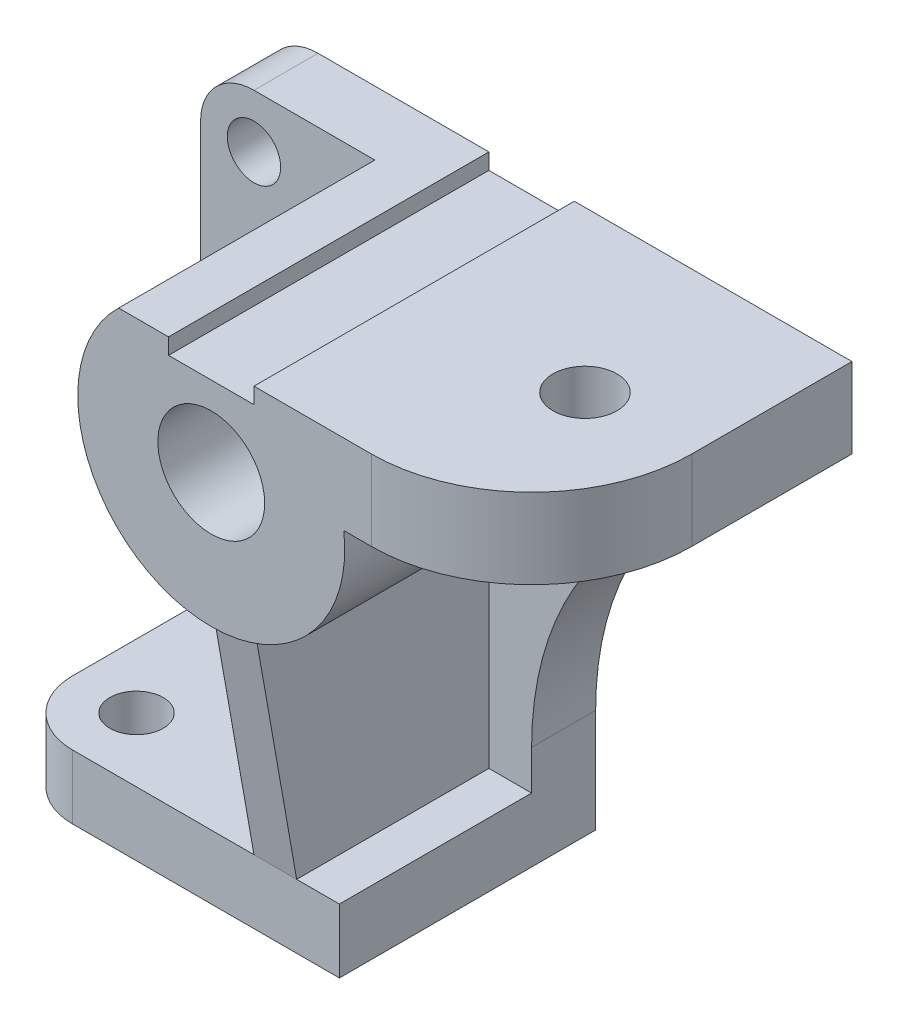
ISO-10303-21;
HEADER;
FILE_DESCRIPTION(('STEP AP214'),'2;1');
FILE_NAME('part.step','',(''),(''),'','','');
FILE_SCHEMA(('AUTOMOTIVE_DESIGN { 1 0 10303 214 1 1 1 1 }'));
ENDSEC;
DATA;
#1=APPLICATION_CONTEXT('core data for automotive mechanical design processes');
#2=APPLICATION_PROTOCOL_DEFINITION('international standard','automotive_design',2000,#1);
#3=PRODUCT_CONTEXT('',#1,'mechanical');
#4=PRODUCT('Part','Part','',(#3));
#5=PRODUCT_RELATED_PRODUCT_CATEGORY('part','',(#4));
#6=PRODUCT_DEFINITION_FORMATION('','',#4);
#7=PRODUCT_DEFINITION_CONTEXT('part definition',#1,'design');
#8=PRODUCT_DEFINITION('design','',#6,#7);
#9=PRODUCT_DEFINITION_SHAPE('','',#8);
#10=(LENGTH_UNIT() NAMED_UNIT(*) SI_UNIT(.MILLI.,.METRE.));
#11=(NAMED_UNIT(*) PLANE_ANGLE_UNIT() SI_UNIT($,.RADIAN.));
#12=(NAMED_UNIT(*) SI_UNIT($,.STERADIAN.) SOLID_ANGLE_UNIT());
#13=UNCERTAINTY_MEASURE_WITH_UNIT(LENGTH_MEASURE(1.E-05),#10,'distance_accuracy_value','');
#14=(GEOMETRIC_REPRESENTATION_CONTEXT(3) GLOBAL_UNCERTAINTY_ASSIGNED_CONTEXT((#13)) GLOBAL_UNIT_ASSIGNED_CONTEXT((#10,
#11,#12)) REPRESENTATION_CONTEXT('',''));
#15=CARTESIAN_POINT('',(0.,0.,0.));
#16=DIRECTION('',(0.,0.,1.));
#17=DIRECTION('',(1.,0.,0.));
#18=AXIS2_PLACEMENT_3D('',#15,#16,#17);
#19=CARTESIAN_POINT('',(122.,19.4182867015248,12.));
#20=DIRECTION('',(0.,0.,-1.));
#21=DIRECTION('',(-1.,0.,0.));
#22=AXIS2_PLACEMENT_3D('',#19,#20,#21);
#23=PLANE('',#22);
#24=CARTESIAN_POINT('',(10.,90.,12.));
#25=DIRECTION('',(0.,0.,1.));
#26=DIRECTION('',(1.,0.,0.));
#27=AXIS2_PLACEMENT_3D('',#24,#25,#26);
#28=CIRCLE('',#27,5.);
#29=CARTESIAN_POINT('',(15.,90.,12.));
#30=VERTEX_POINT('',#29);
#31=EDGE_CURVE('E321',#30,#30,#28,.T.);
#32=ORIENTED_EDGE('',*,*,#31,.F.);
#33=EDGE_LOOP('',(#32));
#34=FACE_BOUND('',#33,.T.);
#35=DIRECTION('',(0.,-1.,0.));
#36=VECTOR('',#35,1.);
#37=CARTESIAN_POINT('',(46.,19.4182867015248,12.));
#38=LINE('',#37,#36);
#39=CARTESIAN_POINT('',(46.,57.3220746414939,12.));
#40=VERTEX_POINT('',#39);
#41=CARTESIAN_POINT('',(46.,12.,12.));
#42=VERTEX_POINT('',#41);
#43=EDGE_CURVE('E207',#40,#42,#38,.T.);
#44=ORIENTED_EDGE('',*,*,#43,.F.);
#45=CARTESIAN_POINT('',(50.,82.,12.));
#46=DIRECTION('',(0.,0.,1.));
#47=DIRECTION('',(1.,0.,0.));
#48=AXIS2_PLACEMENT_3D('',#45,#46,#47);
#49=CIRCLE('',#48,25.);
#50=CARTESIAN_POINT('',(32.6506484271025,100.,12.));
#51=VERTEX_POINT('',#50);
#52=EDGE_CURVE('E191',#51,#40,#49,.T.);
#53=ORIENTED_EDGE('',*,*,#52,.F.);
#54=DIRECTION('',(-1.,0.,0.));
#55=VECTOR('',#54,1.);
#56=CARTESIAN_POINT('',(10.,100.,12.));
#57=LINE('',#56,#55);
#58=CARTESIAN_POINT('',(10.,100.,12.));
#59=VERTEX_POINT('',#58);
#60=EDGE_CURVE('E327',#51,#59,#57,.T.);
#61=ORIENTED_EDGE('',*,*,#60,.T.);
#62=CARTESIAN_POINT('',(10.,90.,12.));
#63=DIRECTION('',(0.,0.,1.));
#64=DIRECTION('',(1.,0.,0.));
#65=AXIS2_PLACEMENT_3D('',#62,#63,#64);
#66=CIRCLE('',#65,10.);
#67=CARTESIAN_POINT('',(0.,90.,12.));
#68=VERTEX_POINT('',#67);
#69=EDGE_CURVE('E329',#59,#68,#66,.T.);
#70=ORIENTED_EDGE('',*,*,#69,.T.);
#71=DIRECTION('',(0.,-1.,0.));
#72=VECTOR('',#71,1.);
#73=CARTESIAN_POINT('',(0.,90.,12.));
#74=LINE('',#73,#72);
#75=CARTESIAN_POINT('',(0.,12.,12.));
#76=VERTEX_POINT('',#75);
#77=EDGE_CURVE('E332',#68,#76,#74,.T.);
#78=ORIENTED_EDGE('',*,*,#77,.T.);
#79=DIRECTION('',(1.,0.,0.));
#80=VECTOR('',#79,1.);
#81=CARTESIAN_POINT('',(0.,12.,12.));
#82=LINE('',#81,#80);
#83=EDGE_CURVE('E209',#76,#42,#82,.T.);
#84=ORIENTED_EDGE('',*,*,#83,.T.);
#85=EDGE_LOOP('',(#44,#53,#61,#70,#78,#84));
#86=FACE_BOUND('',#85,.T.);
#87=ADVANCED_FACE('F36',(#34,#86),#23,.F.);
#88=CARTESIAN_POINT('',(12.,12.,36.));
#89=DIRECTION('',(0.,-1.,0.));
#90=DIRECTION('',(0.,0.,-1.));
#91=AXIS2_PLACEMENT_3D('',#88,#89,#90);
#92=PLANE('',#91);
#93=CARTESIAN_POINT('',(12.,12.,36.));
#94=DIRECTION('',(0.,-1.,0.));
#95=DIRECTION('',(0.,0.,-1.));
#96=AXIS2_PLACEMENT_3D('',#93,#94,#95);
#97=CIRCLE('',#96,5.);
#98=CARTESIAN_POINT('',(12.,12.,31.));
#99=VERTEX_POINT('',#98);
#100=EDGE_CURVE('E288',#99,#99,#97,.T.);
#101=ORIENTED_EDGE('',*,*,#100,.T.);
#102=EDGE_LOOP('',(#101));
#103=FACE_BOUND('',#102,.T.);
#104=DIRECTION('',(0.,0.,1.));
#105=VECTOR('',#104,1.);
#106=CARTESIAN_POINT('',(46.,12.,36.));
#107=LINE('',#106,#105);
#108=CARTESIAN_POINT('',(46.,12.,48.));
#109=VERTEX_POINT('',#108);
#110=EDGE_CURVE('E212',#42,#109,#107,.T.);
#111=ORIENTED_EDGE('',*,*,#110,.F.);
#112=ORIENTED_EDGE('',*,*,#83,.F.);
#113=DIRECTION('',(0.,0.,-1.));
#114=VECTOR('',#113,1.);
#115=CARTESIAN_POINT('',(0.,12.,12.));
#116=LINE('',#115,#114);
#117=CARTESIAN_POINT('',(0.,12.,35.9999999999999));
#118=VERTEX_POINT('',#117);
#119=EDGE_CURVE('E304',#118,#76,#116,.T.);
#120=ORIENTED_EDGE('',*,*,#119,.F.);
#121=CARTESIAN_POINT('',(12.,12.,36.));
#122=DIRECTION('',(0.,-1.,0.));
#123=DIRECTION('',(0.,0.,-1.));
#124=AXIS2_PLACEMENT_3D('',#121,#122,#123);
#125=CIRCLE('',#124,12.);
#126=CARTESIAN_POINT('',(12.0000000000001,12.,48.));
#127=VERTEX_POINT('',#126);
#128=EDGE_CURVE('E301',#127,#118,#125,.T.);
#129=ORIENTED_EDGE('',*,*,#128,.F.);
#130=DIRECTION('',(-1.,0.,0.));
#131=VECTOR('',#130,1.);
#132=CARTESIAN_POINT('',(62.,12.,48.));
#133=LINE('',#132,#131);
#134=EDGE_CURVE('E51',#109,#127,#133,.T.);
#135=ORIENTED_EDGE('',*,*,#134,.F.);
#136=EDGE_LOOP('',(#111,#112,#120,#129,#135));
#137=FACE_BOUND('',#136,.T.);
#138=ADVANCED_FACE('F473',(#103,#137),#92,.F.);
#139=CARTESIAN_POINT('',(10.,100.,12.));
#140=DIRECTION('',(0.,-1.,0.));
#141=DIRECTION('',(0.,0.,-1.));
#142=AXIS2_PLACEMENT_3D('',#139,#140,#141);
#143=PLANE('',#142);
#144=DIRECTION('',(-1.,0.,0.));
#145=VECTOR('',#144,1.);
#146=CARTESIAN_POINT('',(32.6506484271025,100.,60.));
#147=LINE('',#146,#145);
#148=CARTESIAN_POINT('',(42.,100.,60.));
#149=VERTEX_POINT('',#148);
#150=CARTESIAN_POINT('',(32.6506484271025,100.,60.));
#151=VERTEX_POINT('',#150);
#152=EDGE_CURVE('E277',#149,#151,#147,.T.);
#153=ORIENTED_EDGE('',*,*,#152,.F.);
#154=DIRECTION('',(0.,0.,1.));
#155=VECTOR('',#154,1.);
#156=CARTESIAN_POINT('',(42.,100.,0.));
#157=LINE('',#156,#155);
#158=CARTESIAN_POINT('',(42.,100.,0.));
#159=VERTEX_POINT('',#158);
#160=EDGE_CURVE('E255',#159,#149,#157,.T.);
#161=ORIENTED_EDGE('',*,*,#160,.F.);
#162=DIRECTION('',(-1.,0.,0.));
#163=VECTOR('',#162,1.);
#164=CARTESIAN_POINT('',(10.,100.,0.));
#165=LINE('',#164,#163);
#166=CARTESIAN_POINT('',(10.,100.,0.));
#167=VERTEX_POINT('',#166);
#168=EDGE_CURVE('E343',#159,#167,#165,.T.);
#169=ORIENTED_EDGE('',*,*,#168,.T.);
#170=DIRECTION('',(0.,0.,-1.));
#171=VECTOR('',#170,1.);
#172=CARTESIAN_POINT('',(10.,100.,12.));
#173=LINE('',#172,#171);
#174=EDGE_CURVE('E380',#59,#167,#173,.T.);
#175=ORIENTED_EDGE('',*,*,#174,.F.);
#176=ORIENTED_EDGE('',*,*,#60,.F.);
#177=DIRECTION('',(0.,0.,-1.));
#178=VECTOR('',#177,1.);
#179=CARTESIAN_POINT('',(32.6506484271025,100.,60.));
#180=LINE('',#179,#178);
#181=EDGE_CURVE('E199',#151,#51,#180,.T.);
#182=ORIENTED_EDGE('',*,*,#181,.F.);
#183=EDGE_LOOP('',(#153,#161,#169,#175,#176,#182));
#184=FACE_BOUND('',#183,.T.);
#185=ADVANCED_FACE('F426',(#184),#143,.F.);
#186=CARTESIAN_POINT('',(54.,57.3220746414939,12.));
#187=VERTEX_POINT('',#186);
#188=CARTESIAN_POINT('',(74.8193472919817,85.,12.));
#189=VERTEX_POINT('',#188);
#190=EDGE_CURVE('E203',#187,#189,#49,.T.);
#191=ORIENTED_EDGE('',*,*,#190,.F.);
#192=DIRECTION('',(0.,-1.,0.));
#193=VECTOR('',#192,1.);
#194=CARTESIAN_POINT('',(54.,19.4182867015248,12.));
#195=LINE('',#194,#193);
#196=CARTESIAN_POINT('',(54.,12.,12.));
#197=VERTEX_POINT('',#196);
#198=EDGE_CURVE('E227',#187,#197,#195,.T.);
#199=ORIENTED_EDGE('',*,*,#198,.T.);
#200=CARTESIAN_POINT('',(62.,12.,12.));
#201=VERTEX_POINT('',#200);
#202=EDGE_CURVE('E296',#197,#201,#82,.T.);
#203=ORIENTED_EDGE('',*,*,#202,.T.);
#204=DIRECTION('',(0.,1.,0.));
#205=VECTOR('',#204,1.);
#206=CARTESIAN_POINT('',(62.,0.,12.));
#207=LINE('',#206,#205);
#208=CARTESIAN_POINT('',(62.,19.4182867015248,12.));
#209=VERTEX_POINT('',#208);
#210=EDGE_CURVE('E334',#201,#209,#207,.T.);
#211=ORIENTED_EDGE('',*,*,#210,.T.);
#212=CARTESIAN_POINT('',(122.,19.4182867015248,12.));
#213=DIRECTION('',(0.,0.,-1.));
#214=DIRECTION('',(-1.,0.,0.));
#215=AXIS2_PLACEMENT_3D('',#212,#213,#214);
#216=CIRCLE('',#215,60.);
#217=CARTESIAN_POINT('',(95.,73.,12.));
#218=VERTEX_POINT('',#217);
#219=EDGE_CURVE('E336',#209,#218,#216,.T.);
#220=ORIENTED_EDGE('',*,*,#219,.T.);
#221=DIRECTION('',(0.,1.,0.));
#222=VECTOR('',#221,1.);
#223=CARTESIAN_POINT('',(95.,85.,12.));
#224=LINE('',#223,#222);
#225=CARTESIAN_POINT('',(95.,85.,12.));
#226=VERTEX_POINT('',#225);
#227=EDGE_CURVE('E338',#218,#226,#224,.T.);
#228=ORIENTED_EDGE('',*,*,#227,.T.);
#229=DIRECTION('',(1.,0.,0.));
#230=VECTOR('',#229,1.);
#231=CARTESIAN_POINT('',(110.,85.,12.));
#232=LINE('',#231,#230);
#233=EDGE_CURVE('E202',#189,#226,#232,.T.);
#234=ORIENTED_EDGE('',*,*,#233,.F.);
#235=EDGE_LOOP('',(#191,#199,#203,#211,#220,#228,#234));
#236=FACE_BOUND('',#235,.T.);
#237=ADVANCED_FACE('F433',(#236),#23,.F.);
#238=CARTESIAN_POINT('',(122.,19.4182867015248,0.));
#239=DIRECTION('',(0.,0.,-1.));
#240=DIRECTION('',(-1.,0.,0.));
#241=AXIS2_PLACEMENT_3D('',#238,#239,#240);
#242=PLANE('',#241);
#243=CARTESIAN_POINT('',(50.,82.,0.));
#244=DIRECTION('',(0.,0.,1.));
#245=DIRECTION('',(1.,0.,0.));
#246=AXIS2_PLACEMENT_3D('',#243,#244,#245);
#247=CIRCLE('',#246,10.);
#248=CARTESIAN_POINT('',(60.,82.,0.));
#249=VERTEX_POINT('',#248);
#250=EDGE_CURVE('E266',#249,#249,#247,.T.);
#251=ORIENTED_EDGE('',*,*,#250,.T.);
#252=EDGE_LOOP('',(#251));
#253=FACE_BOUND('',#252,.T.);
#254=DIRECTION('',(1.,0.,0.));
#255=VECTOR('',#254,1.);
#256=CARTESIAN_POINT('',(42.,97.,0.));
#257=LINE('',#256,#255);
#258=CARTESIAN_POINT('',(42.,97.,0.));
#259=VERTEX_POINT('',#258);
#260=CARTESIAN_POINT('',(58.,97.,0.));
#261=VERTEX_POINT('',#260);
#262=EDGE_CURVE('E244',#259,#261,#257,.T.);
#263=ORIENTED_EDGE('',*,*,#262,.T.);
#264=DIRECTION('',(0.,1.,0.));
#265=VECTOR('',#264,1.);
#266=CARTESIAN_POINT('',(58.,100.,0.));
#267=LINE('',#266,#265);
#268=CARTESIAN_POINT('',(58.,100.,0.));
#269=VERTEX_POINT('',#268);
#270=EDGE_CURVE('E247',#261,#269,#267,.T.);
#271=ORIENTED_EDGE('',*,*,#270,.T.);
#272=CARTESIAN_POINT('',(110.,100.,0.));
#273=VERTEX_POINT('',#272);
#274=EDGE_CURVE('E344',#273,#269,#165,.T.);
#275=ORIENTED_EDGE('',*,*,#274,.F.);
#276=DIRECTION('',(0.,1.,0.));
#277=VECTOR('',#276,1.);
#278=CARTESIAN_POINT('',(110.,100.,0.));
#279=LINE('',#278,#277);
#280=CARTESIAN_POINT('',(110.,85.,0.));
#281=VERTEX_POINT('',#280);
#282=EDGE_CURVE('E324',#281,#273,#279,.T.);
#283=ORIENTED_EDGE('',*,*,#282,.F.);
#284=DIRECTION('',(1.,0.,0.));
#285=VECTOR('',#284,1.);
#286=CARTESIAN_POINT('',(110.,85.,0.));
#287=LINE('',#286,#285);
#288=CARTESIAN_POINT('',(95.,85.,0.));
#289=VERTEX_POINT('',#288);
#290=EDGE_CURVE('E330',#289,#281,#287,.T.);
#291=ORIENTED_EDGE('',*,*,#290,.F.);
#292=DIRECTION('',(0.,1.,0.));
#293=VECTOR('',#292,1.);
#294=CARTESIAN_POINT('',(95.,85.,0.));
#295=LINE('',#294,#293);
#296=CARTESIAN_POINT('',(95.,73.,0.));
#297=VERTEX_POINT('',#296);
#298=EDGE_CURVE('E357',#297,#289,#295,.T.);
#299=ORIENTED_EDGE('',*,*,#298,.F.);
#300=CARTESIAN_POINT('',(122.,19.4182867015248,0.));
#301=DIRECTION('',(0.,0.,-1.));
#302=DIRECTION('',(-1.,0.,0.));
#303=AXIS2_PLACEMENT_3D('',#300,#301,#302);
#304=CIRCLE('',#303,60.);
#305=CARTESIAN_POINT('',(62.,19.4182867015248,0.));
#306=VERTEX_POINT('',#305);
#307=EDGE_CURVE('E355',#306,#297,#304,.T.);
#308=ORIENTED_EDGE('',*,*,#307,.F.);
#309=DIRECTION('',(0.,1.,0.));
#310=VECTOR('',#309,1.);
#311=CARTESIAN_POINT('',(62.,0.,0.));
#312=LINE('',#311,#310);
#313=CARTESIAN_POINT('',(62.,0.,0.));
#314=VERTEX_POINT('',#313);
#315=EDGE_CURVE('E353',#314,#306,#312,.T.);
#316=ORIENTED_EDGE('',*,*,#315,.F.);
#317=DIRECTION('',(1.,0.,0.));
#318=VECTOR('',#317,1.);
#319=CARTESIAN_POINT('',(0.,0.,0.));
#320=LINE('',#319,#318);
#321=CARTESIAN_POINT('',(0.,0.,0.));
#322=VERTEX_POINT('',#321);
#323=EDGE_CURVE('E351',#322,#314,#320,.T.);
#324=ORIENTED_EDGE('',*,*,#323,.F.);
#325=DIRECTION('',(0.,-1.,0.));
#326=VECTOR('',#325,1.);
#327=CARTESIAN_POINT('',(0.,90.,0.));
#328=LINE('',#327,#326);
#329=CARTESIAN_POINT('',(0.,90.,0.));
#330=VERTEX_POINT('',#329);
#331=EDGE_CURVE('E349',#330,#322,#328,.T.);
#332=ORIENTED_EDGE('',*,*,#331,.F.);
#333=CARTESIAN_POINT('',(10.,90.,0.));
#334=DIRECTION('',(0.,0.,1.));
#335=DIRECTION('',(1.,0.,0.));
#336=AXIS2_PLACEMENT_3D('',#333,#334,#335);
#337=CIRCLE('',#336,10.);
#338=EDGE_CURVE('E347',#167,#330,#337,.T.);
#339=ORIENTED_EDGE('',*,*,#338,.F.);
#340=ORIENTED_EDGE('',*,*,#168,.F.);
#341=DIRECTION('',(0.,-1.,0.));
#342=VECTOR('',#341,1.);
#343=CARTESIAN_POINT('',(42.,100.,0.));
#344=LINE('',#343,#342);
#345=EDGE_CURVE('E241',#159,#259,#344,.T.);
#346=ORIENTED_EDGE('',*,*,#345,.T.);
#347=EDGE_LOOP('',(#263,#271,#275,#283,#291,#299,#308,#316,#324,#332,#339,#340,#346));
#348=FACE_BOUND('',#347,.T.);
#349=CARTESIAN_POINT('',(10.,90.,0.));
#350=DIRECTION('',(0.,0.,1.));
#351=DIRECTION('',(1.,0.,0.));
#352=AXIS2_PLACEMENT_3D('',#349,#350,#351);
#353=CIRCLE('',#352,5.);
#354=CARTESIAN_POINT('',(15.,90.,0.));
#355=VERTEX_POINT('',#354);
#356=EDGE_CURVE('E316',#355,#355,#353,.T.);
#357=ORIENTED_EDGE('',*,*,#356,.T.);
#358=EDGE_LOOP('',(#357));
#359=FACE_BOUND('',#358,.T.);
#360=ADVANCED_FACE('F413',(#253,#348,#359),#242,.T.);
#361=CARTESIAN_POINT('',(110.,100.,12.));
#362=DIRECTION('',(-1.,0.,0.));
#363=DIRECTION('',(0.,-1.,0.));
#364=AXIS2_PLACEMENT_3D('',#361,#362,#363);
#365=PLANE('',#364);
#366=DIRECTION('',(0.,0.,-1.));
#367=VECTOR('',#366,1.);
#368=CARTESIAN_POINT('',(110.,100.,12.));
#369=LINE('',#368,#367);
#370=CARTESIAN_POINT('',(110.,100.,30.));
#371=VERTEX_POINT('',#370);
#372=EDGE_CURVE('E383',#371,#273,#369,.T.);
#373=ORIENTED_EDGE('',*,*,#372,.F.);
#374=DIRECTION('',(0.,1.,0.));
#375=VECTOR('',#374,1.);
#376=CARTESIAN_POINT('',(110.,85.,30.));
#377=LINE('',#376,#375);
#378=CARTESIAN_POINT('',(110.,85.,30.));
#379=VERTEX_POINT('',#378);
#380=EDGE_CURVE('E44',#371,#379,#377,.F.);
#381=ORIENTED_EDGE('',*,*,#380,.T.);
#382=DIRECTION('',(0.,0.,-1.));
#383=VECTOR('',#382,1.);
#384=CARTESIAN_POINT('',(110.,85.,12.));
#385=LINE('',#384,#383);
#386=EDGE_CURVE('E340',#379,#281,#385,.T.);
#387=ORIENTED_EDGE('',*,*,#386,.T.);
#388=ORIENTED_EDGE('',*,*,#282,.T.);
#389=EDGE_LOOP('',(#373,#381,#387,#388));
#390=FACE_BOUND('',#389,.T.);
#391=ADVANCED_FACE('F393',(#390),#365,.F.);
#392=CARTESIAN_POINT('',(90.,100.,30.));
#393=DIRECTION('',(0.,1.,0.));
#394=DIRECTION('',(0.,0.,1.));
#395=AXIS2_PLACEMENT_3D('',#392,#393,#394);
#396=CIRCLE('',#395,6.);
#397=CARTESIAN_POINT('',(90.,100.,36.));
#398=VERTEX_POINT('',#397);
#399=EDGE_CURVE('E234',#398,#398,#396,.T.);
#400=ORIENTED_EDGE('',*,*,#399,.F.);
#401=EDGE_LOOP('',(#400));
#402=FACE_BOUND('',#401,.T.);
#403=ORIENTED_EDGE('',*,*,#274,.T.);
#404=DIRECTION('',(0.,0.,1.));
#405=VECTOR('',#404,1.);
#406=CARTESIAN_POINT('',(58.,100.,0.));
#407=LINE('',#406,#405);
#408=CARTESIAN_POINT('',(58.,100.,60.));
#409=VERTEX_POINT('',#408);
#410=EDGE_CURVE('E258',#269,#409,#407,.T.);
#411=ORIENTED_EDGE('',*,*,#410,.T.);
#412=CARTESIAN_POINT('',(80.,100.,60.));
#413=VERTEX_POINT('',#412);
#414=EDGE_CURVE('E278',#413,#409,#147,.T.);
#415=ORIENTED_EDGE('',*,*,#414,.F.);
#416=CARTESIAN_POINT('',(80.,100.,30.));
#417=DIRECTION('',(0.,-1.,0.));
#418=DIRECTION('',(0.,0.,-1.));
#419=AXIS2_PLACEMENT_3D('',#416,#417,#418);
#420=CIRCLE('',#419,30.);
#421=EDGE_CURVE('E388',#413,#371,#420,.F.);
#422=ORIENTED_EDGE('',*,*,#421,.T.);
#423=ORIENTED_EDGE('',*,*,#372,.T.);
#424=EDGE_LOOP('',(#403,#411,#415,#422,#423));
#425=FACE_BOUND('',#424,.T.);
#426=ADVANCED_FACE('F407',(#402,#425),#143,.F.);
#427=CARTESIAN_POINT('',(10.,90.,12.));
#428=DIRECTION('',(0.,0.,-1.));
#429=DIRECTION('',(-1.,0.,0.));
#430=AXIS2_PLACEMENT_3D('',#427,#428,#429);
#431=CYLINDRICAL_SURFACE('',#430,10.);
#432=ORIENTED_EDGE('',*,*,#338,.T.);
#433=DIRECTION('',(0.,0.,-1.));
#434=VECTOR('',#433,1.);
#435=CARTESIAN_POINT('',(0.,90.,12.));
#436=LINE('',#435,#434);
#437=EDGE_CURVE('E377',#68,#330,#436,.T.);
#438=ORIENTED_EDGE('',*,*,#437,.F.);
#439=ORIENTED_EDGE('',*,*,#69,.F.);
#440=ORIENTED_EDGE('',*,*,#174,.T.);
#441=EDGE_LOOP('',(#432,#438,#439,#440));
#442=FACE_BOUND('',#441,.T.);
#443=ADVANCED_FACE('F462',(#442),#431,.T.);
#444=CARTESIAN_POINT('',(0.,90.,12.));
#445=DIRECTION('',(1.,0.,0.));
#446=DIRECTION('',(0.,0.,-1.));
#447=AXIS2_PLACEMENT_3D('',#444,#445,#446);
#448=PLANE('',#447);
#449=ORIENTED_EDGE('',*,*,#331,.T.);
#450=DIRECTION('',(0.,0.,-1.));
#451=VECTOR('',#450,1.);
#452=CARTESIAN_POINT('',(0.,0.,12.));
#453=LINE('',#452,#451);
#454=CARTESIAN_POINT('',(0.,0.,35.9999999999999));
#455=VERTEX_POINT('',#454);
#456=EDGE_CURVE('E374',#455,#322,#453,.T.);
#457=ORIENTED_EDGE('',*,*,#456,.F.);
#458=DIRECTION('',(0.,-1.,0.));
#459=VECTOR('',#458,1.);
#460=CARTESIAN_POINT('',(0.,12.,35.9999999999999));
#461=LINE('',#460,#459);
#462=EDGE_CURVE('E313',#118,#455,#461,.T.);
#463=ORIENTED_EDGE('',*,*,#462,.F.);
#464=ORIENTED_EDGE('',*,*,#119,.T.);
#465=ORIENTED_EDGE('',*,*,#77,.F.);
#466=ORIENTED_EDGE('',*,*,#437,.T.);
#467=EDGE_LOOP('',(#449,#457,#463,#464,#465,#466));
#468=FACE_BOUND('',#467,.T.);
#469=ADVANCED_FACE('F457',(#468),#448,.F.);
#470=CARTESIAN_POINT('',(0.,0.,12.));
#471=DIRECTION('',(0.,1.,0.));
#472=DIRECTION('',(0.,0.,1.));
#473=AXIS2_PLACEMENT_3D('',#470,#471,#472);
#474=PLANE('',#473);
#475=ORIENTED_EDGE('',*,*,#323,.T.);
#476=DIRECTION('',(0.,0.,-1.));
#477=VECTOR('',#476,1.);
#478=CARTESIAN_POINT('',(62.,0.,12.));
#479=LINE('',#478,#477);
#480=CARTESIAN_POINT('',(62.,0.,48.));
#481=VERTEX_POINT('',#480);
#482=EDGE_CURVE('E371',#481,#314,#479,.T.);
#483=ORIENTED_EDGE('',*,*,#482,.F.);
#484=DIRECTION('',(-1.,0.,0.));
#485=VECTOR('',#484,1.);
#486=CARTESIAN_POINT('',(62.,0.,48.));
#487=LINE('',#486,#485);
#488=CARTESIAN_POINT('',(12.0000000000001,0.,48.));
#489=VERTEX_POINT('',#488);
#490=EDGE_CURVE('E291',#481,#489,#487,.T.);
#491=ORIENTED_EDGE('',*,*,#490,.T.);
#492=CARTESIAN_POINT('',(12.,0.,36.));
#493=DIRECTION('',(0.,-1.,0.));
#494=DIRECTION('',(0.,0.,-1.));
#495=AXIS2_PLACEMENT_3D('',#492,#493,#494);
#496=CIRCLE('',#495,12.);
#497=EDGE_CURVE('E310',#489,#455,#496,.T.);
#498=ORIENTED_EDGE('',*,*,#497,.T.);
#499=ORIENTED_EDGE('',*,*,#456,.T.);
#500=EDGE_LOOP('',(#475,#483,#491,#498,#499));
#501=FACE_BOUND('',#500,.T.);
#502=CARTESIAN_POINT('',(12.,0.,36.));
#503=DIRECTION('',(0.,-1.,0.));
#504=DIRECTION('',(0.,0.,-1.));
#505=AXIS2_PLACEMENT_3D('',#502,#503,#504);
#506=CIRCLE('',#505,5.);
#507=CARTESIAN_POINT('',(12.,0.,31.));
#508=VERTEX_POINT('',#507);
#509=EDGE_CURVE('E287',#508,#508,#506,.T.);
#510=ORIENTED_EDGE('',*,*,#509,.F.);
#511=EDGE_LOOP('',(#510));
#512=FACE_BOUND('',#511,.T.);
#513=ADVANCED_FACE('F452',(#501,#512),#474,.F.);
#514=CARTESIAN_POINT('',(62.,0.,12.));
#515=DIRECTION('',(-1.,0.,0.));
#516=DIRECTION('',(0.,0.,1.));
#517=AXIS2_PLACEMENT_3D('',#514,#515,#516);
#518=PLANE('',#517);
#519=ORIENTED_EDGE('',*,*,#315,.T.);
#520=DIRECTION('',(0.,0.,-1.));
#521=VECTOR('',#520,1.);
#522=CARTESIAN_POINT('',(62.,19.4182867015248,12.));
#523=LINE('',#522,#521);
#524=EDGE_CURVE('E368',#209,#306,#523,.T.);
#525=ORIENTED_EDGE('',*,*,#524,.F.);
#526=ORIENTED_EDGE('',*,*,#210,.F.);
#527=DIRECTION('',(0.,0.,1.));
#528=VECTOR('',#527,1.);
#529=CARTESIAN_POINT('',(62.,12.,12.));
#530=LINE('',#529,#528);
#531=CARTESIAN_POINT('',(62.,12.,48.));
#532=VERTEX_POINT('',#531);
#533=EDGE_CURVE('E295',#201,#532,#530,.T.);
#534=ORIENTED_EDGE('',*,*,#533,.T.);
#535=DIRECTION('',(0.,-1.,0.));
#536=VECTOR('',#535,1.);
#537=CARTESIAN_POINT('',(62.,12.,48.));
#538=LINE('',#537,#536);
#539=EDGE_CURVE('E307',#532,#481,#538,.T.);
#540=ORIENTED_EDGE('',*,*,#539,.T.);
#541=ORIENTED_EDGE('',*,*,#482,.T.);
#542=EDGE_LOOP('',(#519,#525,#526,#534,#540,#541));
#543=FACE_BOUND('',#542,.T.);
#544=ADVANCED_FACE('F449',(#543),#518,.F.);
#545=CARTESIAN_POINT('',(122.,19.4182867015248,12.));
#546=DIRECTION('',(0.,0.,-1.));
#547=DIRECTION('',(-1.,0.,0.));
#548=AXIS2_PLACEMENT_3D('',#545,#546,#547);
#549=CYLINDRICAL_SURFACE('',#548,60.);
#550=ORIENTED_EDGE('',*,*,#307,.T.);
#551=DIRECTION('',(0.,0.,-1.));
#552=VECTOR('',#551,1.);
#553=CARTESIAN_POINT('',(95.,73.,12.));
#554=LINE('',#553,#552);
#555=EDGE_CURVE('E365',#218,#297,#554,.T.);
#556=ORIENTED_EDGE('',*,*,#555,.F.);
#557=ORIENTED_EDGE('',*,*,#219,.F.);
#558=ORIENTED_EDGE('',*,*,#524,.T.);
#559=EDGE_LOOP('',(#550,#556,#557,#558));
#560=FACE_BOUND('',#559,.T.);
#561=ADVANCED_FACE('F445',(#560),#549,.F.);
#562=CARTESIAN_POINT('',(95.,85.,12.));
#563=DIRECTION('',(-1.,0.,0.));
#564=DIRECTION('',(0.,0.,1.));
#565=AXIS2_PLACEMENT_3D('',#562,#563,#564);
#566=PLANE('',#565);
#567=ORIENTED_EDGE('',*,*,#298,.T.);
#568=DIRECTION('',(0.,0.,-1.));
#569=VECTOR('',#568,1.);
#570=CARTESIAN_POINT('',(95.,85.,12.));
#571=LINE('',#570,#569);
#572=EDGE_CURVE('E362',#226,#289,#571,.T.);
#573=ORIENTED_EDGE('',*,*,#572,.F.);
#574=ORIENTED_EDGE('',*,*,#227,.F.);
#575=ORIENTED_EDGE('',*,*,#555,.T.);
#576=EDGE_LOOP('',(#567,#573,#574,#575));
#577=FACE_BOUND('',#576,.T.);
#578=ADVANCED_FACE('F439',(#577),#566,.F.);
#579=CARTESIAN_POINT('',(110.,85.,12.));
#580=DIRECTION('',(0.,1.,0.));
#581=DIRECTION('',(0.,0.,1.));
#582=AXIS2_PLACEMENT_3D('',#579,#580,#581);
#583=PLANE('',#582);
#584=CARTESIAN_POINT('',(90.,85.,30.));
#585=DIRECTION('',(0.,1.,0.));
#586=DIRECTION('',(0.,0.,1.));
#587=AXIS2_PLACEMENT_3D('',#584,#585,#586);
#588=CIRCLE('',#587,6.);
#589=CARTESIAN_POINT('',(90.,85.,36.));
#590=VERTEX_POINT('',#589);
#591=EDGE_CURVE('E237',#590,#590,#588,.F.);
#592=ORIENTED_EDGE('',*,*,#591,.F.);
#593=EDGE_LOOP('',(#592));
#594=FACE_BOUND('',#593,.T.);
#595=ORIENTED_EDGE('',*,*,#386,.F.);
#596=CARTESIAN_POINT('',(80.,85.,30.));
#597=DIRECTION('',(0.,1.,0.));
#598=DIRECTION('',(0.,0.,1.));
#599=AXIS2_PLACEMENT_3D('',#596,#597,#598);
#600=CIRCLE('',#599,30.);
#601=CARTESIAN_POINT('',(80.,85.,60.));
#602=VERTEX_POINT('',#601);
#603=EDGE_CURVE('E11',#379,#602,#600,.F.);
#604=ORIENTED_EDGE('',*,*,#603,.T.);
#605=DIRECTION('',(1.,0.,0.));
#606=VECTOR('',#605,1.);
#607=CARTESIAN_POINT('',(110.,85.,60.));
#608=LINE('',#607,#606);
#609=CARTESIAN_POINT('',(74.8193472919817,85.,60.));
#610=VERTEX_POINT('',#609);
#611=EDGE_CURVE('E274',#610,#602,#608,.T.);
#612=ORIENTED_EDGE('',*,*,#611,.F.);
#613=DIRECTION('',(0.,0.,-1.));
#614=VECTOR('',#613,1.);
#615=CARTESIAN_POINT('',(74.8193472919817,85.,60.));
#616=LINE('',#615,#614);
#617=EDGE_CURVE('E284',#610,#189,#616,.T.);
#618=ORIENTED_EDGE('',*,*,#617,.T.);
#619=ORIENTED_EDGE('',*,*,#233,.T.);
#620=ORIENTED_EDGE('',*,*,#572,.T.);
#621=ORIENTED_EDGE('',*,*,#290,.T.);
#622=EDGE_LOOP('',(#595,#604,#612,#618,#619,#620,#621));
#623=FACE_BOUND('',#622,.T.);
#624=ADVANCED_FACE('F397',(#594,#623),#583,.F.);
#625=CARTESIAN_POINT('',(10.,90.,12.));
#626=DIRECTION('',(0.,0.,-1.));
#627=DIRECTION('',(-1.,0.,0.));
#628=AXIS2_PLACEMENT_3D('',#625,#626,#627);
#629=CYLINDRICAL_SURFACE('',#628,5.);
#630=ORIENTED_EDGE('',*,*,#31,.T.);
#631=EDGE_LOOP('',(#630));
#632=FACE_BOUND('',#631,.T.);
#633=ORIENTED_EDGE('',*,*,#356,.F.);
#634=EDGE_LOOP('',(#633));
#635=FACE_BOUND('',#634,.T.);
#636=ADVANCED_FACE('F519',(#632,#635),#629,.F.);
#637=CARTESIAN_POINT('',(12.,12.,36.));
#638=DIRECTION('',(0.,-1.,0.));
#639=DIRECTION('',(0.,0.,-1.));
#640=AXIS2_PLACEMENT_3D('',#637,#638,#639);
#641=CYLINDRICAL_SURFACE('',#640,12.);
#642=ORIENTED_EDGE('',*,*,#497,.F.);
#643=DIRECTION('',(0.,-1.,0.));
#644=VECTOR('',#643,1.);
#645=CARTESIAN_POINT('',(12.0000000000001,12.,48.));
#646=LINE('',#645,#644);
#647=EDGE_CURVE('E317',#127,#489,#646,.T.);
#648=ORIENTED_EDGE('',*,*,#647,.F.);
#649=ORIENTED_EDGE('',*,*,#128,.T.);
#650=ORIENTED_EDGE('',*,*,#462,.T.);
#651=EDGE_LOOP('',(#642,#648,#649,#650));
#652=FACE_BOUND('',#651,.T.);
#653=ADVANCED_FACE('F581',(#652),#641,.T.);
#654=CARTESIAN_POINT('',(62.,12.,48.));
#655=DIRECTION('',(0.,0.,1.));
#656=DIRECTION('',(1.,0.,0.));
#657=AXIS2_PLACEMENT_3D('',#654,#655,#656);
#658=PLANE('',#657);
#659=ORIENTED_EDGE('',*,*,#490,.F.);
#660=ORIENTED_EDGE('',*,*,#539,.F.);
#661=CARTESIAN_POINT('',(54.,12.,48.));
#662=VERTEX_POINT('',#661);
#663=EDGE_CURVE('E299',#532,#662,#133,.T.);
#664=ORIENTED_EDGE('',*,*,#663,.T.);
#665=DIRECTION('',(1.,0.,0.));
#666=VECTOR('',#665,1.);
#667=CARTESIAN_POINT('',(12.,12.,48.));
#668=LINE('',#667,#666);
#669=EDGE_CURVE('E232',#662,#109,#668,.F.);
#670=ORIENTED_EDGE('',*,*,#669,.T.);
#671=ORIENTED_EDGE('',*,*,#134,.T.);
#672=ORIENTED_EDGE('',*,*,#647,.T.);
#673=EDGE_LOOP('',(#659,#660,#664,#670,#671,#672));
#674=FACE_BOUND('',#673,.T.);
#675=ADVANCED_FACE('F576',(#674),#658,.T.);
#676=ORIENTED_EDGE('',*,*,#202,.F.);
#677=DIRECTION('',(0.,0.,1.));
#678=VECTOR('',#677,1.);
#679=CARTESIAN_POINT('',(54.,12.,36.));
#680=LINE('',#679,#678);
#681=EDGE_CURVE('E59',#197,#662,#680,.T.);
#682=ORIENTED_EDGE('',*,*,#681,.T.);
#683=ORIENTED_EDGE('',*,*,#663,.F.);
#684=ORIENTED_EDGE('',*,*,#533,.F.);
#685=EDGE_LOOP('',(#676,#682,#683,#684));
#686=FACE_BOUND('',#685,.T.);
#687=ADVANCED_FACE('F481',(#686),#92,.F.);
#688=CARTESIAN_POINT('',(12.,12.,36.));
#689=DIRECTION('',(0.,-1.,0.));
#690=DIRECTION('',(0.,0.,-1.));
#691=AXIS2_PLACEMENT_3D('',#688,#689,#690);
#692=CYLINDRICAL_SURFACE('',#691,5.);
#693=ORIENTED_EDGE('',*,*,#100,.F.);
#694=EDGE_LOOP('',(#693));
#695=FACE_BOUND('',#694,.T.);
#696=ORIENTED_EDGE('',*,*,#509,.T.);
#697=EDGE_LOOP('',(#696));
#698=FACE_BOUND('',#697,.T.);
#699=ADVANCED_FACE('F593',(#695,#698),#692,.F.);
#700=CARTESIAN_POINT('',(50.,82.,60.));
#701=DIRECTION('',(0.,0.,-1.));
#702=DIRECTION('',(-1.,0.,0.));
#703=AXIS2_PLACEMENT_3D('',#700,#701,#702);
#704=CYLINDRICAL_SURFACE('',#703,25.);
#705=CARTESIAN_POINT('',(50.,82.,60.3428886495923));
#706=DIRECTION('',(0.,0.173648177666927,-0.984807753012209));
#707=DIRECTION('',(0.,-0.984807753012209,-0.173648177666927));
#708=AXIS2_PLACEMENT_3D('',#705,#706,#707);
#709=ELLIPSE('',#708,25.3856652971436,25.);
#710=CARTESIAN_POINT('',(46.,57.3220746414939,55.9915045809782));
#711=VERTEX_POINT('',#710);
#712=CARTESIAN_POINT('',(54.,57.3220746414939,55.9915045809782));
#713=VERTEX_POINT('',#712);
#714=EDGE_CURVE('E230',#711,#713,#709,.F.);
#715=ORIENTED_EDGE('',*,*,#714,.T.);
#716=DIRECTION('',(0.,0.,-1.));
#717=VECTOR('',#716,1.);
#718=CARTESIAN_POINT('',(54.,57.3220746414939,60.));
#719=LINE('',#718,#717);
#720=EDGE_CURVE('E225',#713,#187,#719,.T.);
#721=ORIENTED_EDGE('',*,*,#720,.T.);
#722=ORIENTED_EDGE('',*,*,#190,.T.);
#723=ORIENTED_EDGE('',*,*,#617,.F.);
#724=CARTESIAN_POINT('',(50.,82.,60.));
#725=DIRECTION('',(0.,0.,1.));
#726=DIRECTION('',(1.,0.,0.));
#727=AXIS2_PLACEMENT_3D('',#724,#725,#726);
#728=CIRCLE('',#727,25.);
#729=EDGE_CURVE('E271',#151,#610,#728,.T.);
#730=ORIENTED_EDGE('',*,*,#729,.F.);
#731=ORIENTED_EDGE('',*,*,#181,.T.);
#732=ORIENTED_EDGE('',*,*,#52,.T.);
#733=DIRECTION('',(0.,0.,-1.));
#734=VECTOR('',#733,1.);
#735=CARTESIAN_POINT('',(46.,57.3220746414939,60.));
#736=LINE('',#735,#734);
#737=EDGE_CURVE('E195',#711,#40,#736,.T.);
#738=ORIENTED_EDGE('',*,*,#737,.F.);
#739=EDGE_LOOP('',(#715,#721,#722,#723,#730,#731,#732,#738));
#740=FACE_BOUND('',#739,.T.);
#741=ADVANCED_FACE('F193',(#740),#704,.T.);
#742=CARTESIAN_POINT('',(50.,82.,60.));
#743=DIRECTION('',(0.,0.,1.));
#744=DIRECTION('',(1.,0.,0.));
#745=AXIS2_PLACEMENT_3D('',#742,#743,#744);
#746=PLANE('',#745);
#747=DIRECTION('',(0.,1.,0.));
#748=VECTOR('',#747,1.);
#749=CARTESIAN_POINT('',(58.,100.,60.));
#750=LINE('',#749,#748);
#751=CARTESIAN_POINT('',(58.,97.,60.));
#752=VERTEX_POINT('',#751);
#753=EDGE_CURVE('E245',#752,#409,#750,.T.);
#754=ORIENTED_EDGE('',*,*,#753,.F.);
#755=DIRECTION('',(1.,0.,0.));
#756=VECTOR('',#755,1.);
#757=CARTESIAN_POINT('',(42.,97.,60.));
#758=LINE('',#757,#756);
#759=CARTESIAN_POINT('',(42.,97.,60.));
#760=VERTEX_POINT('',#759);
#761=EDGE_CURVE('E252',#760,#752,#758,.T.);
#762=ORIENTED_EDGE('',*,*,#761,.F.);
#763=DIRECTION('',(0.,-1.,0.));
#764=VECTOR('',#763,1.);
#765=CARTESIAN_POINT('',(42.,100.,60.));
#766=LINE('',#765,#764);
#767=EDGE_CURVE('E240',#149,#760,#766,.T.);
#768=ORIENTED_EDGE('',*,*,#767,.F.);
#769=ORIENTED_EDGE('',*,*,#152,.T.);
#770=ORIENTED_EDGE('',*,*,#729,.T.);
#771=ORIENTED_EDGE('',*,*,#611,.T.);
#772=DIRECTION('',(0.,1.,0.));
#773=VECTOR('',#772,1.);
#774=CARTESIAN_POINT('',(80.,100.,60.));
#775=LINE('',#774,#773);
#776=EDGE_CURVE('E385',#602,#413,#775,.T.);
#777=ORIENTED_EDGE('',*,*,#776,.T.);
#778=ORIENTED_EDGE('',*,*,#414,.T.);
#779=EDGE_LOOP('',(#754,#762,#768,#769,#770,#771,#777,#778));
#780=FACE_BOUND('',#779,.T.);
#781=CARTESIAN_POINT('',(50.,82.,60.));
#782=DIRECTION('',(0.,0.,1.));
#783=DIRECTION('',(1.,0.,0.));
#784=AXIS2_PLACEMENT_3D('',#781,#782,#783);
#785=CIRCLE('',#784,10.);
#786=CARTESIAN_POINT('',(60.,82.,60.));
#787=VERTEX_POINT('',#786);
#788=EDGE_CURVE('E257',#787,#787,#785,.T.);
#789=ORIENTED_EDGE('',*,*,#788,.F.);
#790=EDGE_LOOP('',(#789));
#791=FACE_BOUND('',#790,.T.);
#792=ADVANCED_FACE('F404',(#780,#791),#746,.T.);
#793=CARTESIAN_POINT('',(80.,82.,30.));
#794=DIRECTION('',(0.,-1.,0.));
#795=DIRECTION('',(1.,0.,0.));
#796=AXIS2_PLACEMENT_3D('',#793,#794,#795);
#797=CYLINDRICAL_SURFACE('',#796,30.);
#798=ORIENTED_EDGE('',*,*,#603,.F.);
#799=ORIENTED_EDGE('',*,*,#380,.F.);
#800=ORIENTED_EDGE('',*,*,#421,.F.);
#801=ORIENTED_EDGE('',*,*,#776,.F.);
#802=EDGE_LOOP('',(#798,#799,#800,#801));
#803=FACE_BOUND('',#802,.T.);
#804=ADVANCED_FACE('F38',(#803),#797,.T.);
#805=CARTESIAN_POINT('',(50.,82.,0.));
#806=DIRECTION('',(0.,0.,1.));
#807=DIRECTION('',(1.,0.,0.));
#808=AXIS2_PLACEMENT_3D('',#805,#806,#807);
#809=CYLINDRICAL_SURFACE('',#808,10.);
#810=ORIENTED_EDGE('',*,*,#250,.F.);
#811=EDGE_LOOP('',(#810));
#812=FACE_BOUND('',#811,.T.);
#813=ORIENTED_EDGE('',*,*,#788,.T.);
#814=EDGE_LOOP('',(#813));
#815=FACE_BOUND('',#814,.T.);
#816=ADVANCED_FACE('F615',(#812,#815),#809,.F.);
#817=CARTESIAN_POINT('',(42.,100.,0.));
#818=DIRECTION('',(-1.,0.,0.));
#819=DIRECTION('',(0.,0.,1.));
#820=AXIS2_PLACEMENT_3D('',#817,#818,#819);
#821=PLANE('',#820);
#822=ORIENTED_EDGE('',*,*,#767,.T.);
#823=DIRECTION('',(0.,0.,1.));
#824=VECTOR('',#823,1.);
#825=CARTESIAN_POINT('',(42.,97.,0.));
#826=LINE('',#825,#824);
#827=EDGE_CURVE('E250',#259,#760,#826,.T.);
#828=ORIENTED_EDGE('',*,*,#827,.F.);
#829=ORIENTED_EDGE('',*,*,#345,.F.);
#830=ORIENTED_EDGE('',*,*,#160,.T.);
#831=EDGE_LOOP('',(#822,#828,#829,#830));
#832=FACE_BOUND('',#831,.T.);
#833=ADVANCED_FACE('F620',(#832),#821,.F.);
#834=CARTESIAN_POINT('',(58.,100.,0.));
#835=DIRECTION('',(1.,0.,0.));
#836=DIRECTION('',(0.,0.,-1.));
#837=AXIS2_PLACEMENT_3D('',#834,#835,#836);
#838=PLANE('',#837);
#839=ORIENTED_EDGE('',*,*,#753,.T.);
#840=ORIENTED_EDGE('',*,*,#410,.F.);
#841=ORIENTED_EDGE('',*,*,#270,.F.);
#842=DIRECTION('',(0.,0.,1.));
#843=VECTOR('',#842,1.);
#844=CARTESIAN_POINT('',(58.,97.,0.));
#845=LINE('',#844,#843);
#846=EDGE_CURVE('E261',#261,#752,#845,.T.);
#847=ORIENTED_EDGE('',*,*,#846,.T.);
#848=EDGE_LOOP('',(#839,#840,#841,#847));
#849=FACE_BOUND('',#848,.T.);
#850=ADVANCED_FACE('F411',(#849),#838,.F.);
#851=CARTESIAN_POINT('',(42.,97.,0.));
#852=DIRECTION('',(0.,-1.,0.));
#853=DIRECTION('',(0.,0.,-1.));
#854=AXIS2_PLACEMENT_3D('',#851,#852,#853);
#855=PLANE('',#854);
#856=ORIENTED_EDGE('',*,*,#846,.F.);
#857=ORIENTED_EDGE('',*,*,#262,.F.);
#858=ORIENTED_EDGE('',*,*,#827,.T.);
#859=ORIENTED_EDGE('',*,*,#761,.T.);
#860=EDGE_LOOP('',(#856,#857,#858,#859));
#861=FACE_BOUND('',#860,.T.);
#862=ADVANCED_FACE('F419',(#861),#855,.F.);
#863=CARTESIAN_POINT('',(90.,-0.001000000000001,30.));
#864=DIRECTION('',(0.,1.,0.));
#865=DIRECTION('',(0.,0.,1.));
#866=AXIS2_PLACEMENT_3D('',#863,#864,#865);
#867=CYLINDRICAL_SURFACE('',#866,6.);
#868=ORIENTED_EDGE('',*,*,#399,.T.);
#869=EDGE_LOOP('',(#868));
#870=FACE_BOUND('',#869,.T.);
#871=ORIENTED_EDGE('',*,*,#591,.T.);
#872=EDGE_LOOP('',(#871));
#873=FACE_BOUND('',#872,.T.);
#874=ADVANCED_FACE('F529',(#870,#873),#867,.F.);
#875=CARTESIAN_POINT('',(50.,12.,48.));
#876=DIRECTION('',(0.,0.173648177666927,-0.984807753012209));
#877=DIRECTION('',(0.,0.984807753012209,0.173648177666927));
#878=AXIS2_PLACEMENT_3D('',#875,#876,#877);
#879=PLANE('',#878);
#880=ORIENTED_EDGE('',*,*,#669,.F.);
#881=DIRECTION('',(0.,0.984807753012209,0.173648177666927));
#882=VECTOR('',#881,1.);
#883=CARTESIAN_POINT('',(54.,12.,48.));
#884=LINE('',#883,#882);
#885=EDGE_CURVE('E218',#662,#713,#884,.T.);
#886=ORIENTED_EDGE('',*,*,#885,.T.);
#887=ORIENTED_EDGE('',*,*,#714,.F.);
#888=DIRECTION('',(0.,0.984807753012209,0.173648177666927));
#889=VECTOR('',#888,1.);
#890=CARTESIAN_POINT('',(46.,12.,48.));
#891=LINE('',#890,#889);
#892=EDGE_CURVE('E217',#109,#711,#891,.T.);
#893=ORIENTED_EDGE('',*,*,#892,.F.);
#894=EDGE_LOOP('',(#880,#886,#887,#893));
#895=FACE_BOUND('',#894,.T.);
#896=ADVANCED_FACE('F533',(#895),#879,.F.);
#897=CARTESIAN_POINT('',(54.,50.,30.));
#898=DIRECTION('',(1.,0.,0.));
#899=DIRECTION('',(0.,0.,-1.));
#900=AXIS2_PLACEMENT_3D('',#897,#898,#899);
#901=PLANE('',#900);
#902=ORIENTED_EDGE('',*,*,#681,.F.);
#903=ORIENTED_EDGE('',*,*,#198,.F.);
#904=ORIENTED_EDGE('',*,*,#720,.F.);
#905=ORIENTED_EDGE('',*,*,#885,.F.);
#906=EDGE_LOOP('',(#902,#903,#904,#905));
#907=FACE_BOUND('',#906,.T.);
#908=ADVANCED_FACE('F636',(#907),#901,.T.);
#909=CARTESIAN_POINT('',(46.,50.,30.));
#910=DIRECTION('',(1.,0.,0.));
#911=DIRECTION('',(0.,0.,-1.));
#912=AXIS2_PLACEMENT_3D('',#909,#910,#911);
#913=PLANE('',#912);
#914=ORIENTED_EDGE('',*,*,#43,.T.);
#915=ORIENTED_EDGE('',*,*,#110,.T.);
#916=ORIENTED_EDGE('',*,*,#892,.T.);
#917=ORIENTED_EDGE('',*,*,#737,.T.);
#918=EDGE_LOOP('',(#914,#915,#916,#917));
#919=FACE_BOUND('',#918,.T.);
#920=ADVANCED_FACE('F215',(#919),#913,.F.);
#921=CLOSED_SHELL('',(#87,#138,#185,#237,#360,#391,#426,#443,#469,#513,#544,#561,#578,#624,#636,
#653,#675,#687,#699,#741,#792,#804,#816,#833,#850,#862,#874,#896,#908,#920));
#922=MANIFOLD_SOLID_BREP('B2',#921);
#923=ADVANCED_BREP_SHAPE_REPRESENTATION('',(#18,#922),#14);
#924=SHAPE_DEFINITION_REPRESENTATION(#9,#923);
ENDSEC;
END-ISO-10303-21;
